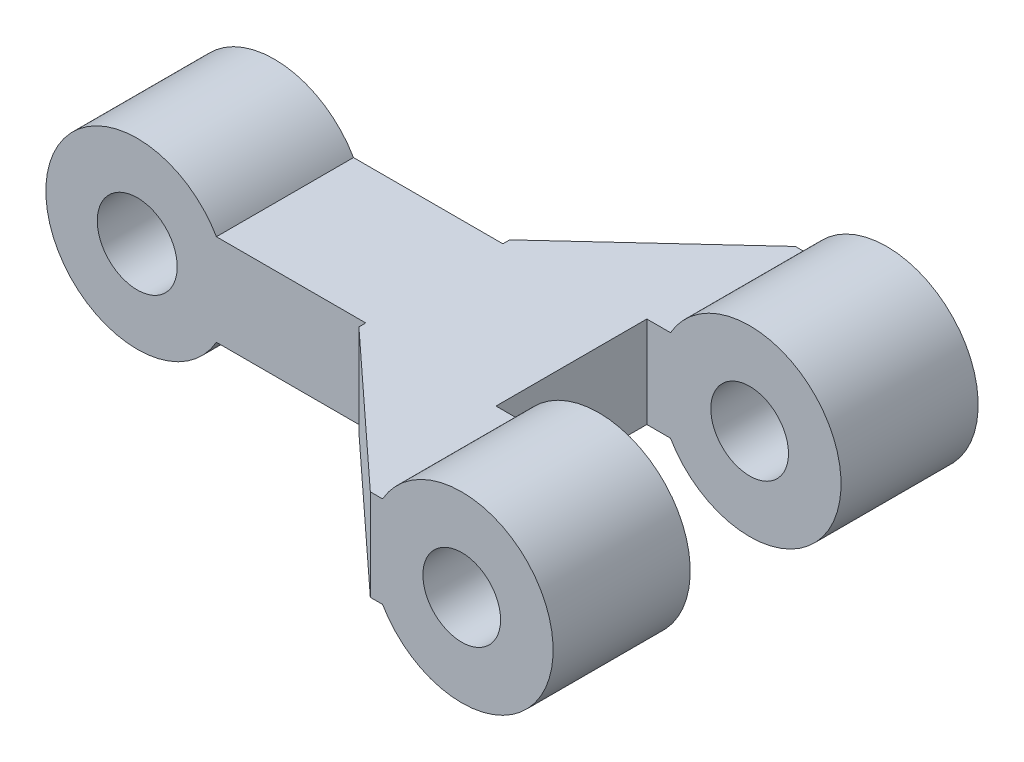
ISO-10303-21;
HEADER;
FILE_DESCRIPTION(('STEP AP214'),'2;1');
FILE_NAME('part.step','',(''),(''),'','','');
FILE_SCHEMA(('AUTOMOTIVE_DESIGN { 1 0 10303 214 1 1 1 1 }'));
ENDSEC;
DATA;
#1=APPLICATION_CONTEXT('core data for automotive mechanical design processes');
#2=APPLICATION_PROTOCOL_DEFINITION('international standard','automotive_design',2000,#1);
#3=PRODUCT_CONTEXT('',#1,'mechanical');
#4=PRODUCT('Part','Part','',(#3));
#5=PRODUCT_RELATED_PRODUCT_CATEGORY('part','',(#4));
#6=PRODUCT_DEFINITION_FORMATION('','',#4);
#7=PRODUCT_DEFINITION_CONTEXT('part definition',#1,'design');
#8=PRODUCT_DEFINITION('design','',#6,#7);
#9=PRODUCT_DEFINITION_SHAPE('','',#8);
#10=(LENGTH_UNIT() NAMED_UNIT(*) SI_UNIT(.MILLI.,.METRE.));
#11=(NAMED_UNIT(*) PLANE_ANGLE_UNIT() SI_UNIT($,.RADIAN.));
#12=(NAMED_UNIT(*) SI_UNIT($,.STERADIAN.) SOLID_ANGLE_UNIT());
#13=UNCERTAINTY_MEASURE_WITH_UNIT(LENGTH_MEASURE(1.E-05),#10,'distance_accuracy_value','');
#14=(GEOMETRIC_REPRESENTATION_CONTEXT(3) GLOBAL_UNCERTAINTY_ASSIGNED_CONTEXT((#13)) GLOBAL_UNIT_ASSIGNED_CONTEXT((#10,
#11,#12)) REPRESENTATION_CONTEXT('',''));
#15=CARTESIAN_POINT('',(0.,0.,0.));
#16=DIRECTION('',(0.,0.,1.));
#17=DIRECTION('',(1.,0.,0.));
#18=AXIS2_PLACEMENT_3D('',#15,#16,#17);
#19=CARTESIAN_POINT('',(-10.5,-2.,6.));
#20=DIRECTION('',(-1.,0.,0.));
#21=DIRECTION('',(0.,0.,1.));
#22=AXIS2_PLACEMENT_3D('',#19,#20,#21);
#23=PLANE('',#22);
#24=DIRECTION('',(0.,0.,1.));
#25=VECTOR('',#24,1.);
#26=CARTESIAN_POINT('',(-10.5,2.,6.));
#27=LINE('',#26,#25);
#28=CARTESIAN_POINT('',(-10.5,2.,12.3));
#29=VERTEX_POINT('',#28);
#30=CARTESIAN_POINT('',(-10.5,2.,12.6));
#31=VERTEX_POINT('',#30);
#32=EDGE_CURVE('E230',#29,#31,#27,.T.);
#33=ORIENTED_EDGE('',*,*,#32,.F.);
#34=DIRECTION('',(0.,-1.,0.));
#35=VECTOR('',#34,1.);
#36=CARTESIAN_POINT('',(-10.5,2.,12.3));
#37=LINE('',#36,#35);
#38=CARTESIAN_POINT('',(-10.5,-2.,12.3));
#39=VERTEX_POINT('',#38);
#40=EDGE_CURVE('E286',#29,#39,#37,.T.);
#41=ORIENTED_EDGE('',*,*,#40,.T.);
#42=DIRECTION('',(0.,0.,1.));
#43=VECTOR('',#42,1.);
#44=CARTESIAN_POINT('',(-10.5,-2.,6.));
#45=LINE('',#44,#43);
#46=CARTESIAN_POINT('',(-10.5,-2.,12.6));
#47=VERTEX_POINT('',#46);
#48=EDGE_CURVE('E167',#39,#47,#45,.T.);
#49=ORIENTED_EDGE('',*,*,#48,.T.);
#50=DIRECTION('',(0.,1.,0.));
#51=VECTOR('',#50,1.);
#52=CARTESIAN_POINT('',(-10.5,-2.,12.6));
#53=LINE('',#52,#51);
#54=EDGE_CURVE('E195',#47,#31,#53,.T.);
#55=ORIENTED_EDGE('',*,*,#54,.T.);
#56=EDGE_LOOP('',(#33,#41,#49,#55));
#57=FACE_BOUND('',#56,.T.);
#58=ADVANCED_FACE('F39',(#57),#23,.T.);
#59=CARTESIAN_POINT('',(0.,0.,6.));
#60=DIRECTION('',(0.,0.,1.));
#61=DIRECTION('',(1.,0.,0.));
#62=AXIS2_PLACEMENT_3D('',#59,#60,#61);
#63=PLANE('',#62);
#64=DIRECTION('',(1.,0.,0.));
#65=VECTOR('',#64,1.);
#66=CARTESIAN_POINT('',(-4.5,-2.,6.));
#67=LINE('',#66,#65);
#68=CARTESIAN_POINT('',(-4.5,-2.,6.));
#69=VERTEX_POINT('',#68);
#70=CARTESIAN_POINT('',(-3.46410161513775,-2.,6.));
#71=VERTEX_POINT('',#70);
#72=EDGE_CURVE('E183',#69,#71,#67,.T.);
#73=ORIENTED_EDGE('',*,*,#72,.T.);
#74=CARTESIAN_POINT('',(0.,0.,6.));
#75=DIRECTION('',(0.,0.,1.));
#76=DIRECTION('',(1.,0.,0.));
#77=AXIS2_PLACEMENT_3D('',#74,#75,#76);
#78=CIRCLE('',#77,4.);
#79=CARTESIAN_POINT('',(-3.46410161513775,2.,6.));
#80=VERTEX_POINT('',#79);
#81=EDGE_CURVE('E206',#71,#80,#78,.T.);
#82=ORIENTED_EDGE('',*,*,#81,.T.);
#83=DIRECTION('',(1.,0.,0.));
#84=VECTOR('',#83,1.);
#85=CARTESIAN_POINT('',(-4.5,2.,6.));
#86=LINE('',#85,#84);
#87=CARTESIAN_POINT('',(-4.5,2.,6.));
#88=VERTEX_POINT('',#87);
#89=EDGE_CURVE('E221',#88,#80,#86,.T.);
#90=ORIENTED_EDGE('',*,*,#89,.F.);
#91=DIRECTION('',(0.,1.,0.));
#92=VECTOR('',#91,1.);
#93=CARTESIAN_POINT('',(-4.5,-2.,6.));
#94=LINE('',#93,#92);
#95=EDGE_CURVE('E187',#69,#88,#94,.T.);
#96=ORIENTED_EDGE('',*,*,#95,.F.);
#97=EDGE_LOOP('',(#73,#82,#90,#96));
#98=FACE_BOUND('',#97,.T.);
#99=CARTESIAN_POINT('',(0.,0.,6.));
#100=DIRECTION('',(0.,0.,1.));
#101=DIRECTION('',(1.,0.,0.));
#102=AXIS2_PLACEMENT_3D('',#99,#100,#101);
#103=CIRCLE('',#102,1.7);
#104=CARTESIAN_POINT('',(1.7,0.,6.));
#105=VERTEX_POINT('',#104);
#106=EDGE_CURVE('E200',#105,#105,#103,.T.);
#107=ORIENTED_EDGE('',*,*,#106,.F.);
#108=EDGE_LOOP('',(#107));
#109=FACE_BOUND('',#108,.T.);
#110=ADVANCED_FACE('F253',(#98,#109),#63,.T.);
#111=CARTESIAN_POINT('',(0.,0.,0.));
#112=DIRECTION('',(0.,0.,1.));
#113=DIRECTION('',(1.,0.,0.));
#114=AXIS2_PLACEMENT_3D('',#111,#112,#113);
#115=PLANE('',#114);
#116=CARTESIAN_POINT('',(0.,0.,0.));
#117=DIRECTION('',(0.,0.,1.));
#118=DIRECTION('',(1.,0.,0.));
#119=AXIS2_PLACEMENT_3D('',#116,#117,#118);
#120=CIRCLE('',#119,4.);
#121=CARTESIAN_POINT('',(-3.46410161513775,-2.,0.));
#122=VERTEX_POINT('',#121);
#123=CARTESIAN_POINT('',(-3.46410161513775,2.,0.));
#124=VERTEX_POINT('',#123);
#125=EDGE_CURVE('E203',#122,#124,#120,.T.);
#126=ORIENTED_EDGE('',*,*,#125,.F.);
#127=DIRECTION('',(-1.,0.,0.));
#128=VECTOR('',#127,1.);
#129=CARTESIAN_POINT('',(-4.,-2.,0.));
#130=LINE('',#129,#128);
#131=CARTESIAN_POINT('',(-4.,-2.,0.));
#132=VERTEX_POINT('',#131);
#133=EDGE_CURVE('E247',#122,#132,#130,.T.);
#134=ORIENTED_EDGE('',*,*,#133,.T.);
#135=DIRECTION('',(0.,1.,0.));
#136=VECTOR('',#135,1.);
#137=CARTESIAN_POINT('',(-4.,-2.,0.));
#138=LINE('',#137,#136);
#139=CARTESIAN_POINT('',(-4.,2.,0.));
#140=VERTEX_POINT('',#139);
#141=EDGE_CURVE('E186',#132,#140,#138,.T.);
#142=ORIENTED_EDGE('',*,*,#141,.T.);
#143=DIRECTION('',(-1.,0.,0.));
#144=VECTOR('',#143,1.);
#145=CARTESIAN_POINT('',(-4.,2.,0.));
#146=LINE('',#145,#144);
#147=EDGE_CURVE('E217',#124,#140,#146,.T.);
#148=ORIENTED_EDGE('',*,*,#147,.F.);
#149=EDGE_LOOP('',(#126,#134,#142,#148));
#150=FACE_BOUND('',#149,.T.);
#151=CARTESIAN_POINT('',(0.,0.,0.));
#152=DIRECTION('',(0.,0.,1.));
#153=DIRECTION('',(1.,0.,0.));
#154=AXIS2_PLACEMENT_3D('',#151,#152,#153);
#155=CIRCLE('',#154,1.7);
#156=CARTESIAN_POINT('',(1.7,0.,0.));
#157=VERTEX_POINT('',#156);
#158=EDGE_CURVE('E189',#157,#157,#155,.T.);
#159=ORIENTED_EDGE('',*,*,#158,.T.);
#160=EDGE_LOOP('',(#159));
#161=FACE_BOUND('',#160,.T.);
#162=ADVANCED_FACE('F223',(#150,#161),#115,.F.);
#163=CARTESIAN_POINT('',(0.,0.,6.));
#164=DIRECTION('',(0.,0.,-1.));
#165=DIRECTION('',(-1.,0.,0.));
#166=AXIS2_PLACEMENT_3D('',#163,#164,#165);
#167=CYLINDRICAL_SURFACE('',#166,4.);
#168=ORIENTED_EDGE('',*,*,#81,.F.);
#169=DIRECTION('',(0.,0.,-1.));
#170=VECTOR('',#169,1.);
#171=CARTESIAN_POINT('',(-3.46410161513775,-2.,6.));
#172=LINE('',#171,#170);
#173=EDGE_CURVE('E11',#71,#122,#172,.T.);
#174=ORIENTED_EDGE('',*,*,#173,.T.);
#175=ORIENTED_EDGE('',*,*,#125,.T.);
#176=DIRECTION('',(0.,0.,-1.));
#177=VECTOR('',#176,1.);
#178=CARTESIAN_POINT('',(-3.46410161513775,2.,6.));
#179=LINE('',#178,#177);
#180=EDGE_CURVE('E47',#80,#124,#179,.T.);
#181=ORIENTED_EDGE('',*,*,#180,.F.);
#182=EDGE_LOOP('',(#168,#174,#175,#181));
#183=FACE_BOUND('',#182,.T.);
#184=ADVANCED_FACE('F41',(#183),#167,.T.);
#185=CARTESIAN_POINT('',(0.,0.,6.));
#186=DIRECTION('',(0.,0.,-1.));
#187=DIRECTION('',(-1.,0.,0.));
#188=AXIS2_PLACEMENT_3D('',#185,#186,#187);
#189=CYLINDRICAL_SURFACE('',#188,1.7);
#190=ORIENTED_EDGE('',*,*,#106,.T.);
#191=EDGE_LOOP('',(#190));
#192=FACE_BOUND('',#191,.T.);
#193=ORIENTED_EDGE('',*,*,#158,.F.);
#194=EDGE_LOOP('',(#193));
#195=FACE_BOUND('',#194,.T.);
#196=ADVANCED_FACE('F342',(#192,#195),#189,.F.);
#197=CARTESIAN_POINT('',(0.,-2.,0.));
#198=DIRECTION('',(0.,-1.,0.));
#199=DIRECTION('',(0.,0.,-1.));
#200=AXIS2_PLACEMENT_3D('',#197,#198,#199);
#201=PLANE('',#200);
#202=DIRECTION('',(0.,0.,1.));
#203=VECTOR('',#202,1.);
#204=CARTESIAN_POINT('',(-3.46410161513775,-2.,12.6));
#205=LINE('',#204,#203);
#206=CARTESIAN_POINT('',(-3.46410161513775,-2.,18.6));
#207=VERTEX_POINT('',#206);
#208=CARTESIAN_POINT('',(-3.46410161513775,-2.,12.6));
#209=VERTEX_POINT('',#208);
#210=EDGE_CURVE('E228',#207,#209,#205,.F.);
#211=ORIENTED_EDGE('',*,*,#210,.F.);
#212=DIRECTION('',(1.,0.,0.));
#213=VECTOR('',#212,1.);
#214=CARTESIAN_POINT('',(-3.,-2.,18.6));
#215=LINE('',#214,#213);
#216=CARTESIAN_POINT('',(-4.,-2.,18.6));
#217=VERTEX_POINT('',#216);
#218=EDGE_CURVE('E170',#217,#207,#215,.T.);
#219=ORIENTED_EDGE('',*,*,#218,.F.);
#220=DIRECTION('',(0.734803444627488,0.,0.678280102733065));
#221=VECTOR('',#220,1.);
#222=CARTESIAN_POINT('',(-10.5,-2.,12.6));
#223=LINE('',#222,#221);
#224=EDGE_CURVE('E166',#47,#217,#223,.T.);
#225=ORIENTED_EDGE('',*,*,#224,.F.);
#226=ORIENTED_EDGE('',*,*,#48,.F.);
#227=DIRECTION('',(-1.,0.,0.));
#228=VECTOR('',#227,1.);
#229=CARTESIAN_POINT('',(-10.5,-2.,12.3));
#230=LINE('',#229,#228);
#231=CARTESIAN_POINT('',(-17.0358983848622,-2.,12.3));
#232=VERTEX_POINT('',#231);
#233=EDGE_CURVE('E54',#39,#232,#230,.T.);
#234=ORIENTED_EDGE('',*,*,#233,.T.);
#235=DIRECTION('',(0.,0.,-1.));
#236=VECTOR('',#235,1.);
#237=CARTESIAN_POINT('',(-17.0358983848622,-2.,12.3));
#238=LINE('',#237,#236);
#239=CARTESIAN_POINT('',(-17.0358983848622,-2.,6.3));
#240=VERTEX_POINT('',#239);
#241=EDGE_CURVE('E147',#232,#240,#238,.T.);
#242=ORIENTED_EDGE('',*,*,#241,.T.);
#243=DIRECTION('',(-1.,0.,0.));
#244=VECTOR('',#243,1.);
#245=CARTESIAN_POINT('',(-10.5,-2.,6.3));
#246=LINE('',#245,#244);
#247=CARTESIAN_POINT('',(-10.5,-2.,6.3));
#248=VERTEX_POINT('',#247);
#249=EDGE_CURVE('E139',#248,#240,#246,.T.);
#250=ORIENTED_EDGE('',*,*,#249,.F.);
#251=CARTESIAN_POINT('',(-10.5,-2.,6.));
#252=VERTEX_POINT('',#251);
#253=EDGE_CURVE('E145',#252,#248,#45,.T.);
#254=ORIENTED_EDGE('',*,*,#253,.F.);
#255=DIRECTION('',(-0.734803444627488,0.,0.678280102733066));
#256=VECTOR('',#255,1.);
#257=CARTESIAN_POINT('',(-4.,-2.,0.));
#258=LINE('',#257,#256);
#259=EDGE_CURVE('E172',#132,#252,#258,.T.);
#260=ORIENTED_EDGE('',*,*,#259,.F.);
#261=ORIENTED_EDGE('',*,*,#133,.F.);
#262=ORIENTED_EDGE('',*,*,#173,.F.);
#263=ORIENTED_EDGE('',*,*,#72,.F.);
#264=DIRECTION('',(0.,0.,-1.));
#265=VECTOR('',#264,1.);
#266=CARTESIAN_POINT('',(-4.5,-2.,12.6));
#267=LINE('',#266,#265);
#268=CARTESIAN_POINT('',(-4.5,-2.,12.6));
#269=VERTEX_POINT('',#268);
#270=EDGE_CURVE('E180',#269,#69,#267,.T.);
#271=ORIENTED_EDGE('',*,*,#270,.F.);
#272=DIRECTION('',(-1.,0.,0.));
#273=VECTOR('',#272,1.);
#274=CARTESIAN_POINT('',(-4.,-2.,12.6));
#275=LINE('',#274,#273);
#276=EDGE_CURVE('E178',#209,#269,#275,.T.);
#277=ORIENTED_EDGE('',*,*,#276,.F.);
#278=EDGE_LOOP('',(#211,#219,#225,#226,#234,#242,#250,#254,#260,#261,#262,#263,#271,#277));
#279=FACE_BOUND('',#278,.T.);
#280=ADVANCED_FACE('F142',(#279),#201,.T.);
#281=CARTESIAN_POINT('',(0.,2.,0.));
#282=DIRECTION('',(0.,-1.,0.));
#283=DIRECTION('',(0.,0.,-1.));
#284=AXIS2_PLACEMENT_3D('',#281,#282,#283);
#285=PLANE('',#284);
#286=DIRECTION('',(1.,0.,0.));
#287=VECTOR('',#286,1.);
#288=CARTESIAN_POINT('',(-3.,2.,18.6));
#289=LINE('',#288,#287);
#290=CARTESIAN_POINT('',(-4.,2.,18.6));
#291=VERTEX_POINT('',#290);
#292=CARTESIAN_POINT('',(-3.46410161513775,2.,18.6));
#293=VERTEX_POINT('',#292);
#294=EDGE_CURVE('E241',#291,#293,#289,.T.);
#295=ORIENTED_EDGE('',*,*,#294,.T.);
#296=DIRECTION('',(0.,0.,1.));
#297=VECTOR('',#296,1.);
#298=CARTESIAN_POINT('',(-3.46410161513775,2.,12.6));
#299=LINE('',#298,#297);
#300=CARTESIAN_POINT('',(-3.46410161513775,2.,12.6));
#301=VERTEX_POINT('',#300);
#302=EDGE_CURVE('E232',#293,#301,#299,.F.);
#303=ORIENTED_EDGE('',*,*,#302,.T.);
#304=DIRECTION('',(-1.,0.,0.));
#305=VECTOR('',#304,1.);
#306=CARTESIAN_POINT('',(-4.,2.,12.6));
#307=LINE('',#306,#305);
#308=CARTESIAN_POINT('',(-4.5,2.,12.6));
#309=VERTEX_POINT('',#308);
#310=EDGE_CURVE('E243',#301,#309,#307,.T.);
#311=ORIENTED_EDGE('',*,*,#310,.T.);
#312=DIRECTION('',(0.,0.,-1.));
#313=VECTOR('',#312,1.);
#314=CARTESIAN_POINT('',(-4.5,2.,12.6));
#315=LINE('',#314,#313);
#316=EDGE_CURVE('E245',#309,#88,#315,.T.);
#317=ORIENTED_EDGE('',*,*,#316,.T.);
#318=ORIENTED_EDGE('',*,*,#89,.T.);
#319=ORIENTED_EDGE('',*,*,#180,.T.);
#320=ORIENTED_EDGE('',*,*,#147,.T.);
#321=DIRECTION('',(-0.734803444627488,0.,0.678280102733066));
#322=VECTOR('',#321,1.);
#323=CARTESIAN_POINT('',(-4.,2.,0.));
#324=LINE('',#323,#322);
#325=CARTESIAN_POINT('',(-10.5,2.,6.));
#326=VERTEX_POINT('',#325);
#327=EDGE_CURVE('E227',#140,#326,#324,.T.);
#328=ORIENTED_EDGE('',*,*,#327,.T.);
#329=CARTESIAN_POINT('',(-10.5,2.,6.3));
#330=VERTEX_POINT('',#329);
#331=EDGE_CURVE('E236',#326,#330,#27,.T.);
#332=ORIENTED_EDGE('',*,*,#331,.T.);
#333=DIRECTION('',(1.,0.,0.));
#334=VECTOR('',#333,1.);
#335=CARTESIAN_POINT('',(-10.5,2.,6.3));
#336=LINE('',#335,#334);
#337=CARTESIAN_POINT('',(-17.0358983848622,2.,6.3));
#338=VERTEX_POINT('',#337);
#339=EDGE_CURVE('E158',#338,#330,#336,.T.);
#340=ORIENTED_EDGE('',*,*,#339,.F.);
#341=DIRECTION('',(0.,0.,-1.));
#342=VECTOR('',#341,1.);
#343=CARTESIAN_POINT('',(-17.0358983848622,2.,12.3));
#344=LINE('',#343,#342);
#345=CARTESIAN_POINT('',(-17.0358983848622,2.,12.3));
#346=VERTEX_POINT('',#345);
#347=EDGE_CURVE('E295',#346,#338,#344,.T.);
#348=ORIENTED_EDGE('',*,*,#347,.F.);
#349=DIRECTION('',(1.,0.,0.));
#350=VECTOR('',#349,1.);
#351=CARTESIAN_POINT('',(-10.5,2.,12.3));
#352=LINE('',#351,#350);
#353=EDGE_CURVE('E282',#346,#29,#352,.T.);
#354=ORIENTED_EDGE('',*,*,#353,.T.);
#355=ORIENTED_EDGE('',*,*,#32,.T.);
#356=DIRECTION('',(0.734803444627488,0.,0.678280102733065));
#357=VECTOR('',#356,1.);
#358=CARTESIAN_POINT('',(-10.5,2.,12.6));
#359=LINE('',#358,#357);
#360=EDGE_CURVE('E238',#31,#291,#359,.T.);
#361=ORIENTED_EDGE('',*,*,#360,.T.);
#362=EDGE_LOOP('',(#295,#303,#311,#317,#318,#319,#320,#328,#332,#340,#348,#354,#355,#361));
#363=FACE_BOUND('',#362,.T.);
#364=ADVANCED_FACE('F215',(#363),#285,.F.);
#365=CARTESIAN_POINT('',(-4.5,-2.,12.6));
#366=DIRECTION('',(1.,0.,0.));
#367=DIRECTION('',(0.,0.,-1.));
#368=AXIS2_PLACEMENT_3D('',#365,#366,#367);
#369=PLANE('',#368);
#370=ORIENTED_EDGE('',*,*,#95,.T.);
#371=ORIENTED_EDGE('',*,*,#316,.F.);
#372=DIRECTION('',(0.,1.,0.));
#373=VECTOR('',#372,1.);
#374=CARTESIAN_POINT('',(-4.5,-2.,12.6));
#375=LINE('',#374,#373);
#376=EDGE_CURVE('E190',#269,#309,#375,.T.);
#377=ORIENTED_EDGE('',*,*,#376,.F.);
#378=ORIENTED_EDGE('',*,*,#270,.T.);
#379=EDGE_LOOP('',(#370,#371,#377,#378));
#380=FACE_BOUND('',#379,.T.);
#381=ADVANCED_FACE('F257',(#380),#369,.T.);
#382=CARTESIAN_POINT('',(-4.,-2.,12.6));
#383=DIRECTION('',(0.,0.,-1.));
#384=DIRECTION('',(-1.,0.,0.));
#385=AXIS2_PLACEMENT_3D('',#382,#383,#384);
#386=PLANE('',#385);
#387=CARTESIAN_POINT('',(0.,0.,12.6));
#388=DIRECTION('',(0.,0.,1.));
#389=DIRECTION('',(1.,0.,0.));
#390=AXIS2_PLACEMENT_3D('',#387,#388,#389);
#391=CIRCLE('',#390,4.);
#392=EDGE_CURVE('E304',#209,#301,#391,.T.);
#393=ORIENTED_EDGE('',*,*,#392,.F.);
#394=ORIENTED_EDGE('',*,*,#276,.T.);
#395=ORIENTED_EDGE('',*,*,#376,.T.);
#396=ORIENTED_EDGE('',*,*,#310,.F.);
#397=EDGE_LOOP('',(#393,#394,#395,#396));
#398=FACE_BOUND('',#397,.T.);
#399=CARTESIAN_POINT('',(0.,0.,12.6));
#400=DIRECTION('',(0.,0.,1.));
#401=DIRECTION('',(1.,0.,0.));
#402=AXIS2_PLACEMENT_3D('',#399,#400,#401);
#403=CIRCLE('',#402,1.7);
#404=CARTESIAN_POINT('',(1.7,0.,12.6));
#405=VERTEX_POINT('',#404);
#406=EDGE_CURVE('E299',#405,#405,#403,.T.);
#407=ORIENTED_EDGE('',*,*,#406,.T.);
#408=EDGE_LOOP('',(#407));
#409=FACE_BOUND('',#408,.T.);
#410=ADVANCED_FACE('F263',(#398,#409),#386,.T.);
#411=CARTESIAN_POINT('',(-3.,-2.,18.6));
#412=DIRECTION('',(0.,0.,1.));
#413=DIRECTION('',(1.,0.,0.));
#414=AXIS2_PLACEMENT_3D('',#411,#412,#413);
#415=PLANE('',#414);
#416=ORIENTED_EDGE('',*,*,#218,.T.);
#417=CARTESIAN_POINT('',(0.,0.,18.6));
#418=DIRECTION('',(0.,0.,1.));
#419=DIRECTION('',(1.,0.,0.));
#420=AXIS2_PLACEMENT_3D('',#417,#418,#419);
#421=CIRCLE('',#420,4.);
#422=EDGE_CURVE('E274',#207,#293,#421,.T.);
#423=ORIENTED_EDGE('',*,*,#422,.T.);
#424=ORIENTED_EDGE('',*,*,#294,.F.);
#425=DIRECTION('',(0.,1.,0.));
#426=VECTOR('',#425,1.);
#427=CARTESIAN_POINT('',(-4.,-2.,18.6));
#428=LINE('',#427,#426);
#429=EDGE_CURVE('E193',#217,#291,#428,.T.);
#430=ORIENTED_EDGE('',*,*,#429,.F.);
#431=EDGE_LOOP('',(#416,#423,#424,#430));
#432=FACE_BOUND('',#431,.T.);
#433=CARTESIAN_POINT('',(0.,0.,18.6));
#434=DIRECTION('',(0.,0.,1.));
#435=DIRECTION('',(1.,0.,0.));
#436=AXIS2_PLACEMENT_3D('',#433,#434,#435);
#437=CIRCLE('',#436,1.7);
#438=CARTESIAN_POINT('',(1.7,0.,18.6));
#439=VERTEX_POINT('',#438);
#440=EDGE_CURVE('E297',#439,#439,#437,.T.);
#441=ORIENTED_EDGE('',*,*,#440,.F.);
#442=EDGE_LOOP('',(#441));
#443=FACE_BOUND('',#442,.T.);
#444=ADVANCED_FACE('F271',(#432,#443),#415,.T.);
#445=CARTESIAN_POINT('',(-10.5,-2.,12.6));
#446=DIRECTION('',(-0.678280102733065,0.,0.734803444627488));
#447=DIRECTION('',(0.734803444627488,0.,0.678280102733065));
#448=AXIS2_PLACEMENT_3D('',#445,#446,#447);
#449=PLANE('',#448);
#450=ORIENTED_EDGE('',*,*,#429,.T.);
#451=ORIENTED_EDGE('',*,*,#360,.F.);
#452=ORIENTED_EDGE('',*,*,#54,.F.);
#453=ORIENTED_EDGE('',*,*,#224,.T.);
#454=EDGE_LOOP('',(#450,#451,#452,#453));
#455=FACE_BOUND('',#454,.T.);
#456=ADVANCED_FACE('F277',(#455),#449,.T.);
#457=DIRECTION('',(0.,-1.,0.));
#458=VECTOR('',#457,1.);
#459=CARTESIAN_POINT('',(-10.5,2.,6.3));
#460=LINE('',#459,#458);
#461=EDGE_CURVE('E152',#330,#248,#460,.T.);
#462=ORIENTED_EDGE('',*,*,#461,.F.);
#463=ORIENTED_EDGE('',*,*,#331,.F.);
#464=DIRECTION('',(0.,1.,0.));
#465=VECTOR('',#464,1.);
#466=CARTESIAN_POINT('',(-10.5,-2.,6.));
#467=LINE('',#466,#465);
#468=EDGE_CURVE('E165',#252,#326,#467,.T.);
#469=ORIENTED_EDGE('',*,*,#468,.F.);
#470=ORIENTED_EDGE('',*,*,#253,.T.);
#471=EDGE_LOOP('',(#462,#463,#469,#470));
#472=FACE_BOUND('',#471,.T.);
#473=ADVANCED_FACE('F164',(#472),#23,.T.);
#474=CARTESIAN_POINT('',(-4.,-2.,0.));
#475=DIRECTION('',(-0.678280102733066,0.,-0.734803444627488));
#476=DIRECTION('',(-0.734803444627488,0.,0.678280102733066));
#477=AXIS2_PLACEMENT_3D('',#474,#475,#476);
#478=PLANE('',#477);
#479=ORIENTED_EDGE('',*,*,#468,.T.);
#480=ORIENTED_EDGE('',*,*,#327,.F.);
#481=ORIENTED_EDGE('',*,*,#141,.F.);
#482=ORIENTED_EDGE('',*,*,#259,.T.);
#483=EDGE_LOOP('',(#479,#480,#481,#482));
#484=FACE_BOUND('',#483,.T.);
#485=ADVANCED_FACE('F249',(#484),#478,.T.);
#486=CARTESIAN_POINT('',(0.,0.,12.6));
#487=DIRECTION('',(0.,0.,1.));
#488=DIRECTION('',(1.,0.,0.));
#489=AXIS2_PLACEMENT_3D('',#486,#487,#488);
#490=CYLINDRICAL_SURFACE('',#489,4.);
#491=ORIENTED_EDGE('',*,*,#422,.F.);
#492=ORIENTED_EDGE('',*,*,#210,.T.);
#493=ORIENTED_EDGE('',*,*,#392,.T.);
#494=ORIENTED_EDGE('',*,*,#302,.F.);
#495=EDGE_LOOP('',(#491,#492,#493,#494));
#496=FACE_BOUND('',#495,.T.);
#497=ADVANCED_FACE('F306',(#496),#490,.T.);
#498=CARTESIAN_POINT('',(0.,0.,12.6));
#499=DIRECTION('',(0.,0.,1.));
#500=DIRECTION('',(1.,0.,0.));
#501=AXIS2_PLACEMENT_3D('',#498,#499,#500);
#502=CYLINDRICAL_SURFACE('',#501,1.7);
#503=ORIENTED_EDGE('',*,*,#406,.F.);
#504=EDGE_LOOP('',(#503));
#505=FACE_BOUND('',#504,.T.);
#506=ORIENTED_EDGE('',*,*,#440,.T.);
#507=EDGE_LOOP('',(#506));
#508=FACE_BOUND('',#507,.T.);
#509=ADVANCED_FACE('F308',(#505,#508),#502,.F.);
#510=CARTESIAN_POINT('',(-20.5,0.,12.3));
#511=DIRECTION('',(0.,0.,-1.));
#512=DIRECTION('',(-1.,0.,0.));
#513=AXIS2_PLACEMENT_3D('',#510,#511,#512);
#514=CYLINDRICAL_SURFACE('',#513,4.);
#515=ORIENTED_EDGE('',*,*,#347,.T.);
#516=CARTESIAN_POINT('',(-20.5,0.,6.3));
#517=DIRECTION('',(0.,0.,-1.));
#518=DIRECTION('',(-1.,0.,0.));
#519=AXIS2_PLACEMENT_3D('',#516,#517,#518);
#520=CIRCLE('',#519,4.);
#521=EDGE_CURVE('E151',#240,#338,#520,.T.);
#522=ORIENTED_EDGE('',*,*,#521,.F.);
#523=ORIENTED_EDGE('',*,*,#241,.F.);
#524=CARTESIAN_POINT('',(-20.5,0.,12.3));
#525=DIRECTION('',(0.,0.,-1.));
#526=DIRECTION('',(-1.,0.,0.));
#527=AXIS2_PLACEMENT_3D('',#524,#525,#526);
#528=CIRCLE('',#527,4.);
#529=EDGE_CURVE('E285',#232,#346,#528,.T.);
#530=ORIENTED_EDGE('',*,*,#529,.T.);
#531=EDGE_LOOP('',(#515,#522,#523,#530));
#532=FACE_BOUND('',#531,.T.);
#533=ADVANCED_FACE('F314',(#532),#514,.T.);
#534=CARTESIAN_POINT('',(-20.5,0.,12.3));
#535=DIRECTION('',(0.,0.,-1.));
#536=DIRECTION('',(-1.,0.,0.));
#537=AXIS2_PLACEMENT_3D('',#534,#535,#536);
#538=PLANE('',#537);
#539=CARTESIAN_POINT('',(-20.5,0.,12.3));
#540=DIRECTION('',(0.,0.,-1.));
#541=DIRECTION('',(-1.,0.,0.));
#542=AXIS2_PLACEMENT_3D('',#539,#540,#541);
#543=CIRCLE('',#542,1.75);
#544=CARTESIAN_POINT('',(-22.25,0.,12.3));
#545=VERTEX_POINT('',#544);
#546=EDGE_CURVE('E290',#545,#545,#543,.T.);
#547=ORIENTED_EDGE('',*,*,#546,.T.);
#548=EDGE_LOOP('',(#547));
#549=FACE_BOUND('',#548,.T.);
#550=ORIENTED_EDGE('',*,*,#40,.F.);
#551=ORIENTED_EDGE('',*,*,#353,.F.);
#552=ORIENTED_EDGE('',*,*,#529,.F.);
#553=ORIENTED_EDGE('',*,*,#233,.F.);
#554=EDGE_LOOP('',(#550,#551,#552,#553));
#555=FACE_BOUND('',#554,.T.);
#556=ADVANCED_FACE('F461',(#549,#555),#538,.F.);
#557=CARTESIAN_POINT('',(-20.5,0.,12.3));
#558=DIRECTION('',(0.,0.,-1.));
#559=DIRECTION('',(-1.,0.,0.));
#560=AXIS2_PLACEMENT_3D('',#557,#558,#559);
#561=CYLINDRICAL_SURFACE('',#560,1.75);
#562=ORIENTED_EDGE('',*,*,#546,.F.);
#563=EDGE_LOOP('',(#562));
#564=FACE_BOUND('',#563,.T.);
#565=CARTESIAN_POINT('',(-20.5,0.,6.3));
#566=DIRECTION('',(0.,0.,-1.));
#567=DIRECTION('',(-1.,0.,0.));
#568=AXIS2_PLACEMENT_3D('',#565,#566,#567);
#569=CIRCLE('',#568,1.75);
#570=CARTESIAN_POINT('',(-22.25,0.,6.3));
#571=VERTEX_POINT('',#570);
#572=EDGE_CURVE('E162',#571,#571,#569,.T.);
#573=ORIENTED_EDGE('',*,*,#572,.T.);
#574=EDGE_LOOP('',(#573));
#575=FACE_BOUND('',#574,.T.);
#576=ADVANCED_FACE('F470',(#564,#575),#561,.F.);
#577=CARTESIAN_POINT('',(-20.5,0.,6.3));
#578=DIRECTION('',(0.,0.,-1.));
#579=DIRECTION('',(-1.,0.,0.));
#580=AXIS2_PLACEMENT_3D('',#577,#578,#579);
#581=PLANE('',#580);
#582=ORIENTED_EDGE('',*,*,#461,.T.);
#583=ORIENTED_EDGE('',*,*,#249,.T.);
#584=ORIENTED_EDGE('',*,*,#521,.T.);
#585=ORIENTED_EDGE('',*,*,#339,.T.);
#586=EDGE_LOOP('',(#582,#583,#584,#585));
#587=FACE_BOUND('',#586,.T.);
#588=ORIENTED_EDGE('',*,*,#572,.F.);
#589=EDGE_LOOP('',(#588));
#590=FACE_BOUND('',#589,.T.);
#591=ADVANCED_FACE('F155',(#587,#590),#581,.T.);
#592=CLOSED_SHELL('',(#58,#110,#162,#184,#196,#280,#364,#381,#410,#444,#456,#473,#485,#497,#509,
#533,#556,#576,#591));
#593=MANIFOLD_SOLID_BREP('B2',#592);
#594=ADVANCED_BREP_SHAPE_REPRESENTATION('',(#18,#593),#14);
#595=SHAPE_DEFINITION_REPRESENTATION(#9,#594);
ENDSEC;
END-ISO-10303-21;
